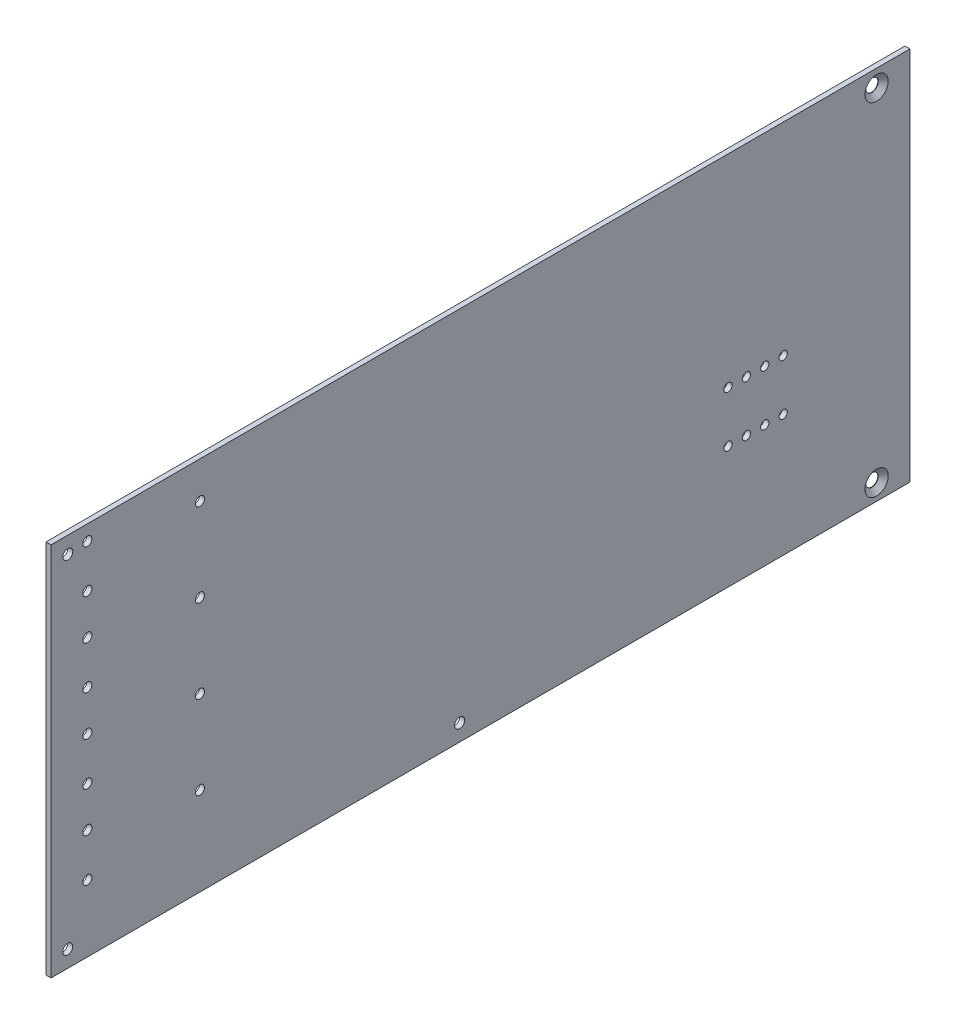
ISO-10303-21;
HEADER;
FILE_DESCRIPTION(('STEP AP214'),'2;1');
FILE_NAME('part.step','',(''),(''),'','','');
FILE_SCHEMA(('AUTOMOTIVE_DESIGN { 1 0 10303 214 1 1 1 1 }'));
ENDSEC;
DATA;
#1=APPLICATION_CONTEXT('core data for automotive mechanical design processes');
#2=APPLICATION_PROTOCOL_DEFINITION('international standard','automotive_design',2000,#1);
#3=PRODUCT_CONTEXT('',#1,'mechanical');
#4=PRODUCT('Part','Part','',(#3));
#5=PRODUCT_RELATED_PRODUCT_CATEGORY('part','',(#4));
#6=PRODUCT_DEFINITION_FORMATION('','',#4);
#7=PRODUCT_DEFINITION_CONTEXT('part definition',#1,'design');
#8=PRODUCT_DEFINITION('design','',#6,#7);
#9=PRODUCT_DEFINITION_SHAPE('','',#8);
#10=(LENGTH_UNIT() NAMED_UNIT(*) SI_UNIT(.MILLI.,.METRE.));
#11=(NAMED_UNIT(*) PLANE_ANGLE_UNIT() SI_UNIT($,.RADIAN.));
#12=(NAMED_UNIT(*) SI_UNIT($,.STERADIAN.) SOLID_ANGLE_UNIT());
#13=UNCERTAINTY_MEASURE_WITH_UNIT(LENGTH_MEASURE(1.E-05),#10,'distance_accuracy_value','');
#14=(GEOMETRIC_REPRESENTATION_CONTEXT(3) GLOBAL_UNCERTAINTY_ASSIGNED_CONTEXT((#13)) GLOBAL_UNIT_ASSIGNED_CONTEXT((#10,
#11,#12)) REPRESENTATION_CONTEXT('',''));
#15=CARTESIAN_POINT('',(0.,0.,0.));
#16=DIRECTION('',(0.,0.,1.));
#17=DIRECTION('',(1.,0.,0.));
#18=AXIS2_PLACEMENT_3D('',#15,#16,#17);
#19=CARTESIAN_POINT('',(-1.524,57.15,130.81));
#20=DIRECTION('',(1.,0.,0.));
#21=DIRECTION('',(0.,1.,0.));
#22=AXIS2_PLACEMENT_3D('',#19,#20,#21);
#23=PLANE('',#22);
#24=DIRECTION('',(0.,-1.,0.));
#25=VECTOR('',#24,1.);
#26=CARTESIAN_POINT('',(-1.524,57.15,-130.81));
#27=LINE('',#26,#25);
#28=CARTESIAN_POINT('',(-1.524,57.15,-130.81));
#29=VERTEX_POINT('',#28);
#30=CARTESIAN_POINT('',(-1.524,-57.15,-130.81));
#31=VERTEX_POINT('',#30);
#32=EDGE_CURVE('E100',#29,#31,#27,.T.);
#33=ORIENTED_EDGE('',*,*,#32,.T.);
#34=DIRECTION('',(0.,0.,-1.));
#35=VECTOR('',#34,1.);
#36=CARTESIAN_POINT('',(-1.524,-57.15,130.81));
#37=LINE('',#36,#35);
#38=CARTESIAN_POINT('',(-1.524,-57.15,130.81));
#39=VERTEX_POINT('',#38);
#40=EDGE_CURVE('E11',#39,#31,#37,.T.);
#41=ORIENTED_EDGE('',*,*,#40,.F.);
#42=DIRECTION('',(0.,-1.,0.));
#43=VECTOR('',#42,1.);
#44=CARTESIAN_POINT('',(-1.524,57.15,130.81));
#45=LINE('',#44,#43);
#46=CARTESIAN_POINT('',(-1.524,57.15,130.81));
#47=VERTEX_POINT('',#46);
#48=EDGE_CURVE('E87',#47,#39,#45,.T.);
#49=ORIENTED_EDGE('',*,*,#48,.F.);
#50=DIRECTION('',(0.,0.,-1.));
#51=VECTOR('',#50,1.);
#52=CARTESIAN_POINT('',(-1.524,57.15,130.81));
#53=LINE('',#52,#51);
#54=EDGE_CURVE('E96',#47,#29,#53,.T.);
#55=ORIENTED_EDGE('',*,*,#54,.T.);
#56=EDGE_LOOP('',(#33,#41,#49,#55));
#57=FACE_BOUND('',#56,.T.);
#58=CARTESIAN_POINT('',(-1.524,-52.197,-120.65));
#59=DIRECTION('',(1.,0.,0.));
#60=DIRECTION('',(0.,0.,-1.));
#61=AXIS2_PLACEMENT_3D('',#58,#59,#60);
#62=CIRCLE('',#61,1.89865);
#63=CARTESIAN_POINT('',(-1.524,-52.197,-122.54865));
#64=VERTEX_POINT('',#63);
#65=EDGE_CURVE('E103',#64,#64,#62,.T.);
#66=ORIENTED_EDGE('',*,*,#65,.T.);
#67=EDGE_LOOP('',(#66));
#68=FACE_BOUND('',#67,.T.);
#69=CARTESIAN_POINT('',(-1.524,51.943,-120.65));
#70=DIRECTION('',(1.,0.,0.));
#71=DIRECTION('',(0.,0.,-1.));
#72=AXIS2_PLACEMENT_3D('',#69,#70,#71);
#73=CIRCLE('',#72,1.89865);
#74=CARTESIAN_POINT('',(-1.524,51.943,-122.54865));
#75=VERTEX_POINT('',#74);
#76=EDGE_CURVE('E253',#75,#75,#73,.T.);
#77=ORIENTED_EDGE('',*,*,#76,.T.);
#78=EDGE_LOOP('',(#77));
#79=FACE_BOUND('',#78,.T.);
#80=CARTESIAN_POINT('',(-1.524,-36.7792,119.761));
#81=DIRECTION('',(-1.,0.,0.));
#82=DIRECTION('',(0.,0.,1.));
#83=AXIS2_PLACEMENT_3D('',#80,#81,#82);
#84=CIRCLE('',#83,1.38912599999999);
#85=CARTESIAN_POINT('',(-1.524,-36.7792,121.150126));
#86=VERTEX_POINT('',#85);
#87=EDGE_CURVE('E241',#86,#86,#84,.T.);
#88=ORIENTED_EDGE('',*,*,#87,.F.);
#89=EDGE_LOOP('',(#88));
#90=FACE_BOUND('',#89,.T.);
#91=CARTESIAN_POINT('',(-1.524,-23.6474,119.761));
#92=DIRECTION('',(-1.,0.,0.));
#93=DIRECTION('',(0.,0.,1.));
#94=AXIS2_PLACEMENT_3D('',#91,#92,#93);
#95=CIRCLE('',#94,1.38912599999999);
#96=CARTESIAN_POINT('',(-1.524,-23.6474,121.150126));
#97=VERTEX_POINT('',#96);
#98=EDGE_CURVE('E235',#97,#97,#95,.T.);
#99=ORIENTED_EDGE('',*,*,#98,.F.);
#100=EDGE_LOOP('',(#99));
#101=FACE_BOUND('',#100,.T.);
#102=CARTESIAN_POINT('',(-1.524,-30.226,85.4709999999999));
#103=DIRECTION('',(-1.,0.,0.));
#104=DIRECTION('',(0.,0.,1.));
#105=AXIS2_PLACEMENT_3D('',#102,#103,#104);
#106=CIRCLE('',#105,1.38912599999999);
#107=CARTESIAN_POINT('',(-1.524,-30.226,86.8601259999999));
#108=VERTEX_POINT('',#107);
#109=EDGE_CURVE('E229',#108,#108,#106,.T.);
#110=ORIENTED_EDGE('',*,*,#109,.F.);
#111=EDGE_LOOP('',(#110));
#112=FACE_BOUND('',#111,.T.);
#113=CARTESIAN_POINT('',(-1.524,-4.82600000000002,85.4709999999999));
#114=DIRECTION('',(-1.,0.,0.));
#115=DIRECTION('',(0.,0.,1.));
#116=AXIS2_PLACEMENT_3D('',#113,#114,#115);
#117=CIRCLE('',#116,1.38912599999999);
#118=CARTESIAN_POINT('',(-1.524,-4.82600000000002,86.8601259999999));
#119=VERTEX_POINT('',#118);
#120=EDGE_CURVE('E223',#119,#119,#117,.T.);
#121=ORIENTED_EDGE('',*,*,#120,.F.);
#122=EDGE_LOOP('',(#121));
#123=FACE_BOUND('',#122,.T.);
#124=CARTESIAN_POINT('',(-1.524,-11.3792,119.761));
#125=DIRECTION('',(-1.,0.,0.));
#126=DIRECTION('',(0.,0.,1.));
#127=AXIS2_PLACEMENT_3D('',#124,#125,#126);
#128=CIRCLE('',#127,1.38912599999999);
#129=CARTESIAN_POINT('',(-1.524,-11.3792,121.150126));
#130=VERTEX_POINT('',#129);
#131=EDGE_CURVE('E217',#130,#130,#128,.T.);
#132=ORIENTED_EDGE('',*,*,#131,.F.);
#133=EDGE_LOOP('',(#132));
#134=FACE_BOUND('',#133,.T.);
#135=CARTESIAN_POINT('',(-1.524,1.75259999999999,119.761));
#136=DIRECTION('',(-1.,0.,0.));
#137=DIRECTION('',(0.,0.,1.));
#138=AXIS2_PLACEMENT_3D('',#135,#136,#137);
#139=CIRCLE('',#138,1.38912599999999);
#140=CARTESIAN_POINT('',(-1.524,1.75259999999999,121.150126));
#141=VERTEX_POINT('',#140);
#142=EDGE_CURVE('E211',#141,#141,#139,.T.);
#143=ORIENTED_EDGE('',*,*,#142,.F.);
#144=EDGE_LOOP('',(#143));
#145=FACE_BOUND('',#144,.T.);
#146=CARTESIAN_POINT('',(-1.524,14.0208,119.761));
#147=DIRECTION('',(-1.,0.,0.));
#148=DIRECTION('',(0.,0.,1.));
#149=AXIS2_PLACEMENT_3D('',#146,#147,#148);
#150=CIRCLE('',#149,1.38912599999999);
#151=CARTESIAN_POINT('',(-1.524,14.0208,121.150126));
#152=VERTEX_POINT('',#151);
#153=EDGE_CURVE('E205',#152,#152,#150,.T.);
#154=ORIENTED_EDGE('',*,*,#153,.F.);
#155=EDGE_LOOP('',(#154));
#156=FACE_BOUND('',#155,.T.);
#157=CARTESIAN_POINT('',(-1.524,20.574,85.4709999999999));
#158=DIRECTION('',(-1.,0.,0.));
#159=DIRECTION('',(0.,0.,1.));
#160=AXIS2_PLACEMENT_3D('',#157,#158,#159);
#161=CIRCLE('',#160,1.38912599999999);
#162=CARTESIAN_POINT('',(-1.524,20.574,86.8601259999999));
#163=VERTEX_POINT('',#162);
#164=EDGE_CURVE('E199',#163,#163,#161,.T.);
#165=ORIENTED_EDGE('',*,*,#164,.F.);
#166=EDGE_LOOP('',(#165));
#167=FACE_BOUND('',#166,.T.);
#168=CARTESIAN_POINT('',(-1.524,27.1526,119.761));
#169=DIRECTION('',(-1.,0.,0.));
#170=DIRECTION('',(0.,0.,1.));
#171=AXIS2_PLACEMENT_3D('',#168,#169,#170);
#172=CIRCLE('',#171,1.38912599999999);
#173=CARTESIAN_POINT('',(-1.524,27.1526,121.150126));
#174=VERTEX_POINT('',#173);
#175=EDGE_CURVE('E193',#174,#174,#172,.T.);
#176=ORIENTED_EDGE('',*,*,#175,.F.);
#177=EDGE_LOOP('',(#176));
#178=FACE_BOUND('',#177,.T.);
#179=CARTESIAN_POINT('',(-1.524,39.4208,119.761));
#180=DIRECTION('',(-1.,0.,0.));
#181=DIRECTION('',(0.,0.,1.));
#182=AXIS2_PLACEMENT_3D('',#179,#180,#181);
#183=CIRCLE('',#182,1.38912599999999);
#184=CARTESIAN_POINT('',(-1.524,39.4208,121.150126));
#185=VERTEX_POINT('',#184);
#186=EDGE_CURVE('E187',#185,#185,#183,.T.);
#187=ORIENTED_EDGE('',*,*,#186,.F.);
#188=EDGE_LOOP('',(#187));
#189=FACE_BOUND('',#188,.T.);
#190=CARTESIAN_POINT('',(-1.524,45.974,85.4709999999999));
#191=DIRECTION('',(-1.,0.,0.));
#192=DIRECTION('',(0.,0.,1.));
#193=AXIS2_PLACEMENT_3D('',#190,#191,#192);
#194=CIRCLE('',#193,1.38912599999999);
#195=CARTESIAN_POINT('',(-1.524,45.974,86.8601259999999));
#196=VERTEX_POINT('',#195);
#197=EDGE_CURVE('E181',#196,#196,#194,.T.);
#198=ORIENTED_EDGE('',*,*,#197,.F.);
#199=EDGE_LOOP('',(#198));
#200=FACE_BOUND('',#199,.T.);
#201=CARTESIAN_POINT('',(-1.524,52.5525999999999,119.761));
#202=DIRECTION('',(-1.,0.,0.));
#203=DIRECTION('',(0.,0.,1.));
#204=AXIS2_PLACEMENT_3D('',#201,#202,#203);
#205=CIRCLE('',#204,1.38912599999999);
#206=CARTESIAN_POINT('',(-1.524,52.5525999999999,121.150126));
#207=VERTEX_POINT('',#206);
#208=EDGE_CURVE('E175',#207,#207,#205,.T.);
#209=ORIENTED_EDGE('',*,*,#208,.F.);
#210=EDGE_LOOP('',(#209));
#211=FACE_BOUND('',#210,.T.);
#212=CARTESIAN_POINT('',(-1.524,-52.07,6.34999999999999));
#213=DIRECTION('',(-1.,0.,0.));
#214=DIRECTION('',(0.,0.,1.));
#215=AXIS2_PLACEMENT_3D('',#212,#213,#214);
#216=CIRCLE('',#215,1.52399999999998);
#217=CARTESIAN_POINT('',(-1.524,-52.07,7.87399999999998));
#218=VERTEX_POINT('',#217);
#219=EDGE_CURVE('E169',#218,#218,#216,.T.);
#220=ORIENTED_EDGE('',*,*,#219,.F.);
#221=EDGE_LOOP('',(#220));
#222=FACE_BOUND('',#221,.T.);
#223=CARTESIAN_POINT('',(-1.524,-52.07,125.73));
#224=DIRECTION('',(-1.,0.,0.));
#225=DIRECTION('',(0.,0.,1.));
#226=AXIS2_PLACEMENT_3D('',#223,#224,#225);
#227=CIRCLE('',#226,1.52399999999998);
#228=CARTESIAN_POINT('',(-1.524,-52.07,127.254));
#229=VERTEX_POINT('',#228);
#230=EDGE_CURVE('E163',#229,#229,#227,.T.);
#231=ORIENTED_EDGE('',*,*,#230,.F.);
#232=EDGE_LOOP('',(#231));
#233=FACE_BOUND('',#232,.T.);
#234=CARTESIAN_POINT('',(-1.524,52.07,125.73));
#235=DIRECTION('',(-1.,0.,0.));
#236=DIRECTION('',(0.,0.,1.));
#237=AXIS2_PLACEMENT_3D('',#234,#235,#236);
#238=CIRCLE('',#237,1.52399999999998);
#239=CARTESIAN_POINT('',(-1.524,52.07,127.254));
#240=VERTEX_POINT('',#239);
#241=EDGE_CURVE('E112',#240,#240,#238,.T.);
#242=ORIENTED_EDGE('',*,*,#241,.F.);
#243=EDGE_LOOP('',(#242));
#244=FACE_BOUND('',#243,.T.);
#245=CARTESIAN_POINT('',(-1.524,-19.939,-92.202));
#246=DIRECTION('',(-1.,0.,0.));
#247=DIRECTION('',(0.,0.,1.));
#248=AXIS2_PLACEMENT_3D('',#245,#246,#247);
#249=CIRCLE('',#248,1.26365);
#250=CARTESIAN_POINT('',(-1.524,-19.939,-90.93835));
#251=VERTEX_POINT('',#250);
#252=EDGE_CURVE('E113',#251,#251,#249,.T.);
#253=ORIENTED_EDGE('',*,*,#252,.F.);
#254=EDGE_LOOP('',(#253));
#255=FACE_BOUND('',#254,.T.);
#256=CARTESIAN_POINT('',(-1.524,-19.939,-86.5886));
#257=DIRECTION('',(-1.,0.,0.));
#258=DIRECTION('',(0.,0.,1.));
#259=AXIS2_PLACEMENT_3D('',#256,#257,#258);
#260=CIRCLE('',#259,1.26365);
#261=CARTESIAN_POINT('',(-1.524,-19.939,-85.32495));
#262=VERTEX_POINT('',#261);
#263=EDGE_CURVE('E117',#262,#262,#260,.T.);
#264=ORIENTED_EDGE('',*,*,#263,.F.);
#265=EDGE_LOOP('',(#264));
#266=FACE_BOUND('',#265,.T.);
#267=CARTESIAN_POINT('',(-1.524,-19.939,-81.0006));
#268=DIRECTION('',(-1.,0.,0.));
#269=DIRECTION('',(0.,0.,1.));
#270=AXIS2_PLACEMENT_3D('',#267,#268,#269);
#271=CIRCLE('',#270,1.26365);
#272=CARTESIAN_POINT('',(-1.524,-19.939,-79.73695));
#273=VERTEX_POINT('',#272);
#274=EDGE_CURVE('E121',#273,#273,#271,.T.);
#275=ORIENTED_EDGE('',*,*,#274,.F.);
#276=EDGE_LOOP('',(#275));
#277=FACE_BOUND('',#276,.T.);
#278=CARTESIAN_POINT('',(-1.524,-19.939,-75.3872));
#279=DIRECTION('',(-1.,0.,0.));
#280=DIRECTION('',(0.,0.,1.));
#281=AXIS2_PLACEMENT_3D('',#278,#279,#280);
#282=CIRCLE('',#281,1.26365);
#283=CARTESIAN_POINT('',(-1.524,-19.939,-74.12355));
#284=VERTEX_POINT('',#283);
#285=EDGE_CURVE('E122',#284,#284,#282,.T.);
#286=ORIENTED_EDGE('',*,*,#285,.F.);
#287=EDGE_LOOP('',(#286));
#288=FACE_BOUND('',#287,.T.);
#289=CARTESIAN_POINT('',(-1.524,-4.44500000000003,-75.3872));
#290=DIRECTION('',(-1.,0.,0.));
#291=DIRECTION('',(0.,0.,1.));
#292=AXIS2_PLACEMENT_3D('',#289,#290,#291);
#293=CIRCLE('',#292,1.26365);
#294=CARTESIAN_POINT('',(-1.524,-4.44500000000003,-74.12355));
#295=VERTEX_POINT('',#294);
#296=EDGE_CURVE('E125',#295,#295,#293,.T.);
#297=ORIENTED_EDGE('',*,*,#296,.F.);
#298=EDGE_LOOP('',(#297));
#299=FACE_BOUND('',#298,.T.);
#300=CARTESIAN_POINT('',(-1.524,-4.44500000000003,-81.0006));
#301=DIRECTION('',(-1.,0.,0.));
#302=DIRECTION('',(0.,0.,1.));
#303=AXIS2_PLACEMENT_3D('',#300,#301,#302);
#304=CIRCLE('',#303,1.26365);
#305=CARTESIAN_POINT('',(-1.524,-4.44500000000003,-79.73695));
#306=VERTEX_POINT('',#305);
#307=EDGE_CURVE('E126',#306,#306,#304,.T.);
#308=ORIENTED_EDGE('',*,*,#307,.F.);
#309=EDGE_LOOP('',(#308));
#310=FACE_BOUND('',#309,.T.);
#311=CARTESIAN_POINT('',(-1.524,-4.44500000000003,-86.5886));
#312=DIRECTION('',(-1.,0.,0.));
#313=DIRECTION('',(0.,0.,1.));
#314=AXIS2_PLACEMENT_3D('',#311,#312,#313);
#315=CIRCLE('',#314,1.26365);
#316=CARTESIAN_POINT('',(-1.524,-4.44500000000003,-85.32495));
#317=VERTEX_POINT('',#316);
#318=EDGE_CURVE('E129',#317,#317,#315,.T.);
#319=ORIENTED_EDGE('',*,*,#318,.F.);
#320=EDGE_LOOP('',(#319));
#321=FACE_BOUND('',#320,.T.);
#322=CARTESIAN_POINT('',(-1.524,-4.44500000000003,-92.202));
#323=DIRECTION('',(-1.,0.,0.));
#324=DIRECTION('',(0.,0.,1.));
#325=AXIS2_PLACEMENT_3D('',#322,#323,#324);
#326=CIRCLE('',#325,1.26365);
#327=CARTESIAN_POINT('',(-1.524,-4.44500000000003,-90.93835));
#328=VERTEX_POINT('',#327);
#329=EDGE_CURVE('E139',#328,#328,#326,.T.);
#330=ORIENTED_EDGE('',*,*,#329,.F.);
#331=EDGE_LOOP('',(#330));
#332=FACE_BOUND('',#331,.T.);
#333=ADVANCED_FACE('F34',(#57,#68,#79,#90,#101,#112,#123,#134,#145,#156,#167,#178,#189,#200,
#211,#222,#233,#244,#255,#266,#277,#288,#299,#310,#321,#332),#23,.F.);
#334=CARTESIAN_POINT('',(-1.524,-57.15,130.81));
#335=DIRECTION('',(0.,1.,0.));
#336=DIRECTION('',(-1.,0.,0.));
#337=AXIS2_PLACEMENT_3D('',#334,#335,#336);
#338=PLANE('',#337);
#339=DIRECTION('',(1.,0.,0.));
#340=VECTOR('',#339,1.);
#341=CARTESIAN_POINT('',(-1.524,-57.15,-130.81));
#342=LINE('',#341,#340);
#343=CARTESIAN_POINT('',(0.,-57.15,-130.81));
#344=VERTEX_POINT('',#343);
#345=EDGE_CURVE('E91',#31,#344,#342,.T.);
#346=ORIENTED_EDGE('',*,*,#345,.T.);
#347=DIRECTION('',(0.,0.,-1.));
#348=VECTOR('',#347,1.);
#349=CARTESIAN_POINT('',(0.,-57.15,130.81));
#350=LINE('',#349,#348);
#351=CARTESIAN_POINT('',(0.,-57.15,130.81));
#352=VERTEX_POINT('',#351);
#353=EDGE_CURVE('E43',#352,#344,#350,.T.);
#354=ORIENTED_EDGE('',*,*,#353,.F.);
#355=DIRECTION('',(1.,0.,0.));
#356=VECTOR('',#355,1.);
#357=CARTESIAN_POINT('',(-1.524,-57.15,130.81));
#358=LINE('',#357,#356);
#359=EDGE_CURVE('E82',#39,#352,#358,.T.);
#360=ORIENTED_EDGE('',*,*,#359,.F.);
#361=ORIENTED_EDGE('',*,*,#40,.T.);
#362=EDGE_LOOP('',(#346,#354,#360,#361));
#363=FACE_BOUND('',#362,.T.);
#364=ADVANCED_FACE('F90',(#363),#338,.F.);
#365=CARTESIAN_POINT('',(0.,57.15,130.81));
#366=DIRECTION('',(-1.,0.,0.));
#367=DIRECTION('',(0.,0.,1.));
#368=AXIS2_PLACEMENT_3D('',#365,#366,#367);
#369=PLANE('',#368);
#370=CARTESIAN_POINT('',(0.,-4.44500000000003,-92.202));
#371=DIRECTION('',(-1.,0.,0.));
#372=DIRECTION('',(0.,0.,1.));
#373=AXIS2_PLACEMENT_3D('',#370,#371,#372);
#374=CIRCLE('',#373,1.26365);
#375=CARTESIAN_POINT('',(0.,-4.44500000000003,-90.93835));
#376=VERTEX_POINT('',#375);
#377=EDGE_CURVE('E37',#376,#376,#374,.T.);
#378=ORIENTED_EDGE('',*,*,#377,.T.);
#379=EDGE_LOOP('',(#378));
#380=FACE_BOUND('',#379,.T.);
#381=CARTESIAN_POINT('',(0.,-4.44500000000003,-86.5886));
#382=DIRECTION('',(-1.,0.,0.));
#383=DIRECTION('',(0.,0.,1.));
#384=AXIS2_PLACEMENT_3D('',#381,#382,#383);
#385=CIRCLE('',#384,1.26365);
#386=CARTESIAN_POINT('',(0.,-4.44500000000003,-85.32495));
#387=VERTEX_POINT('',#386);
#388=EDGE_CURVE('E127',#387,#387,#385,.T.);
#389=ORIENTED_EDGE('',*,*,#388,.T.);
#390=EDGE_LOOP('',(#389));
#391=FACE_BOUND('',#390,.T.);
#392=CARTESIAN_POINT('',(0.,-4.44500000000003,-81.0006));
#393=DIRECTION('',(-1.,0.,0.));
#394=DIRECTION('',(0.,0.,1.));
#395=AXIS2_PLACEMENT_3D('',#392,#393,#394);
#396=CIRCLE('',#395,1.26365);
#397=CARTESIAN_POINT('',(0.,-4.44500000000003,-79.73695));
#398=VERTEX_POINT('',#397);
#399=EDGE_CURVE('E123',#398,#398,#396,.T.);
#400=ORIENTED_EDGE('',*,*,#399,.T.);
#401=EDGE_LOOP('',(#400));
#402=FACE_BOUND('',#401,.T.);
#403=CARTESIAN_POINT('',(0.,-4.44500000000003,-75.3872));
#404=DIRECTION('',(-1.,0.,0.));
#405=DIRECTION('',(0.,0.,1.));
#406=AXIS2_PLACEMENT_3D('',#403,#404,#405);
#407=CIRCLE('',#406,1.26365);
#408=CARTESIAN_POINT('',(0.,-4.44500000000003,-74.12355));
#409=VERTEX_POINT('',#408);
#410=EDGE_CURVE('E144',#409,#409,#407,.T.);
#411=ORIENTED_EDGE('',*,*,#410,.T.);
#412=EDGE_LOOP('',(#411));
#413=FACE_BOUND('',#412,.T.);
#414=CARTESIAN_POINT('',(0.,-19.939,-75.3872));
#415=DIRECTION('',(-1.,0.,0.));
#416=DIRECTION('',(0.,0.,1.));
#417=AXIS2_PLACEMENT_3D('',#414,#415,#416);
#418=CIRCLE('',#417,1.26365);
#419=CARTESIAN_POINT('',(0.,-19.939,-74.12355));
#420=VERTEX_POINT('',#419);
#421=EDGE_CURVE('E118',#420,#420,#418,.T.);
#422=ORIENTED_EDGE('',*,*,#421,.T.);
#423=EDGE_LOOP('',(#422));
#424=FACE_BOUND('',#423,.T.);
#425=CARTESIAN_POINT('',(0.,-19.939,-81.0006));
#426=DIRECTION('',(-1.,0.,0.));
#427=DIRECTION('',(0.,0.,1.));
#428=AXIS2_PLACEMENT_3D('',#425,#426,#427);
#429=CIRCLE('',#428,1.26365);
#430=CARTESIAN_POINT('',(0.,-19.939,-79.73695));
#431=VERTEX_POINT('',#430);
#432=EDGE_CURVE('E151',#431,#431,#429,.T.);
#433=ORIENTED_EDGE('',*,*,#432,.T.);
#434=EDGE_LOOP('',(#433));
#435=FACE_BOUND('',#434,.T.);
#436=CARTESIAN_POINT('',(0.,-19.939,-86.5886));
#437=DIRECTION('',(-1.,0.,0.));
#438=DIRECTION('',(0.,0.,1.));
#439=AXIS2_PLACEMENT_3D('',#436,#437,#438);
#440=CIRCLE('',#439,1.26365);
#441=CARTESIAN_POINT('',(0.,-19.939,-85.32495));
#442=VERTEX_POINT('',#441);
#443=EDGE_CURVE('E114',#442,#442,#440,.T.);
#444=ORIENTED_EDGE('',*,*,#443,.T.);
#445=EDGE_LOOP('',(#444));
#446=FACE_BOUND('',#445,.T.);
#447=CARTESIAN_POINT('',(0.,-19.939,-92.202));
#448=DIRECTION('',(-1.,0.,0.));
#449=DIRECTION('',(0.,0.,1.));
#450=AXIS2_PLACEMENT_3D('',#447,#448,#449);
#451=CIRCLE('',#450,1.26365);
#452=CARTESIAN_POINT('',(0.,-19.939,-90.93835));
#453=VERTEX_POINT('',#452);
#454=EDGE_CURVE('E109',#453,#453,#451,.T.);
#455=ORIENTED_EDGE('',*,*,#454,.T.);
#456=EDGE_LOOP('',(#455));
#457=FACE_BOUND('',#456,.T.);
#458=CARTESIAN_POINT('',(0.,52.07,125.73));
#459=DIRECTION('',(-1.,0.,0.));
#460=DIRECTION('',(0.,0.,1.));
#461=AXIS2_PLACEMENT_3D('',#458,#459,#460);
#462=CIRCLE('',#461,1.524);
#463=CARTESIAN_POINT('',(0.,52.07,127.254));
#464=VERTEX_POINT('',#463);
#465=EDGE_CURVE('E160',#464,#464,#462,.T.);
#466=ORIENTED_EDGE('',*,*,#465,.T.);
#467=EDGE_LOOP('',(#466));
#468=FACE_BOUND('',#467,.T.);
#469=CARTESIAN_POINT('',(0.,-52.07,125.73));
#470=DIRECTION('',(-1.,0.,0.));
#471=DIRECTION('',(0.,0.,1.));
#472=AXIS2_PLACEMENT_3D('',#469,#470,#471);
#473=CIRCLE('',#472,1.524);
#474=CARTESIAN_POINT('',(0.,-52.07,127.254));
#475=VERTEX_POINT('',#474);
#476=EDGE_CURVE('E166',#475,#475,#473,.T.);
#477=ORIENTED_EDGE('',*,*,#476,.T.);
#478=EDGE_LOOP('',(#477));
#479=FACE_BOUND('',#478,.T.);
#480=CARTESIAN_POINT('',(0.,-52.07,6.34999999999999));
#481=DIRECTION('',(-1.,0.,0.));
#482=DIRECTION('',(0.,0.,1.));
#483=AXIS2_PLACEMENT_3D('',#480,#481,#482);
#484=CIRCLE('',#483,1.524);
#485=CARTESIAN_POINT('',(0.,-52.07,7.87399999999999));
#486=VERTEX_POINT('',#485);
#487=EDGE_CURVE('E172',#486,#486,#484,.T.);
#488=ORIENTED_EDGE('',*,*,#487,.T.);
#489=EDGE_LOOP('',(#488));
#490=FACE_BOUND('',#489,.T.);
#491=CARTESIAN_POINT('',(0.,52.5525999999999,119.761));
#492=DIRECTION('',(-1.,0.,0.));
#493=DIRECTION('',(0.,0.,1.));
#494=AXIS2_PLACEMENT_3D('',#491,#492,#493);
#495=CIRCLE('',#494,1.389126);
#496=CARTESIAN_POINT('',(0.,52.5525999999999,121.150126));
#497=VERTEX_POINT('',#496);
#498=EDGE_CURVE('E178',#497,#497,#495,.T.);
#499=ORIENTED_EDGE('',*,*,#498,.T.);
#500=EDGE_LOOP('',(#499));
#501=FACE_BOUND('',#500,.T.);
#502=CARTESIAN_POINT('',(0.,45.974,85.4709999999999));
#503=DIRECTION('',(-1.,0.,0.));
#504=DIRECTION('',(0.,0.,1.));
#505=AXIS2_PLACEMENT_3D('',#502,#503,#504);
#506=CIRCLE('',#505,1.389126);
#507=CARTESIAN_POINT('',(0.,45.974,86.8601259999999));
#508=VERTEX_POINT('',#507);
#509=EDGE_CURVE('E184',#508,#508,#506,.T.);
#510=ORIENTED_EDGE('',*,*,#509,.T.);
#511=EDGE_LOOP('',(#510));
#512=FACE_BOUND('',#511,.T.);
#513=CARTESIAN_POINT('',(0.,39.4208,119.761));
#514=DIRECTION('',(-1.,0.,0.));
#515=DIRECTION('',(0.,0.,1.));
#516=AXIS2_PLACEMENT_3D('',#513,#514,#515);
#517=CIRCLE('',#516,1.389126);
#518=CARTESIAN_POINT('',(0.,39.4208,121.150126));
#519=VERTEX_POINT('',#518);
#520=EDGE_CURVE('E190',#519,#519,#517,.T.);
#521=ORIENTED_EDGE('',*,*,#520,.T.);
#522=EDGE_LOOP('',(#521));
#523=FACE_BOUND('',#522,.T.);
#524=CARTESIAN_POINT('',(0.,27.1526,119.761));
#525=DIRECTION('',(-1.,0.,0.));
#526=DIRECTION('',(0.,0.,1.));
#527=AXIS2_PLACEMENT_3D('',#524,#525,#526);
#528=CIRCLE('',#527,1.389126);
#529=CARTESIAN_POINT('',(0.,27.1526,121.150126));
#530=VERTEX_POINT('',#529);
#531=EDGE_CURVE('E196',#530,#530,#528,.T.);
#532=ORIENTED_EDGE('',*,*,#531,.T.);
#533=EDGE_LOOP('',(#532));
#534=FACE_BOUND('',#533,.T.);
#535=CARTESIAN_POINT('',(0.,20.574,85.4709999999999));
#536=DIRECTION('',(-1.,0.,0.));
#537=DIRECTION('',(0.,0.,1.));
#538=AXIS2_PLACEMENT_3D('',#535,#536,#537);
#539=CIRCLE('',#538,1.389126);
#540=CARTESIAN_POINT('',(0.,20.574,86.8601259999999));
#541=VERTEX_POINT('',#540);
#542=EDGE_CURVE('E202',#541,#541,#539,.T.);
#543=ORIENTED_EDGE('',*,*,#542,.T.);
#544=EDGE_LOOP('',(#543));
#545=FACE_BOUND('',#544,.T.);
#546=CARTESIAN_POINT('',(0.,14.0208,119.761));
#547=DIRECTION('',(-1.,0.,0.));
#548=DIRECTION('',(0.,0.,1.));
#549=AXIS2_PLACEMENT_3D('',#546,#547,#548);
#550=CIRCLE('',#549,1.389126);
#551=CARTESIAN_POINT('',(0.,14.0208,121.150126));
#552=VERTEX_POINT('',#551);
#553=EDGE_CURVE('E208',#552,#552,#550,.T.);
#554=ORIENTED_EDGE('',*,*,#553,.T.);
#555=EDGE_LOOP('',(#554));
#556=FACE_BOUND('',#555,.T.);
#557=CARTESIAN_POINT('',(0.,1.75259999999999,119.761));
#558=DIRECTION('',(-1.,0.,0.));
#559=DIRECTION('',(0.,0.,1.));
#560=AXIS2_PLACEMENT_3D('',#557,#558,#559);
#561=CIRCLE('',#560,1.389126);
#562=CARTESIAN_POINT('',(0.,1.75259999999999,121.150126));
#563=VERTEX_POINT('',#562);
#564=EDGE_CURVE('E214',#563,#563,#561,.T.);
#565=ORIENTED_EDGE('',*,*,#564,.T.);
#566=EDGE_LOOP('',(#565));
#567=FACE_BOUND('',#566,.T.);
#568=CARTESIAN_POINT('',(0.,-11.3792,119.761));
#569=DIRECTION('',(-1.,0.,0.));
#570=DIRECTION('',(0.,0.,1.));
#571=AXIS2_PLACEMENT_3D('',#568,#569,#570);
#572=CIRCLE('',#571,1.389126);
#573=CARTESIAN_POINT('',(0.,-11.3792,121.150126));
#574=VERTEX_POINT('',#573);
#575=EDGE_CURVE('E220',#574,#574,#572,.T.);
#576=ORIENTED_EDGE('',*,*,#575,.T.);
#577=EDGE_LOOP('',(#576));
#578=FACE_BOUND('',#577,.T.);
#579=CARTESIAN_POINT('',(0.,-4.82600000000002,85.4709999999999));
#580=DIRECTION('',(-1.,0.,0.));
#581=DIRECTION('',(0.,0.,1.));
#582=AXIS2_PLACEMENT_3D('',#579,#580,#581);
#583=CIRCLE('',#582,1.389126);
#584=CARTESIAN_POINT('',(0.,-4.82600000000002,86.8601259999999));
#585=VERTEX_POINT('',#584);
#586=EDGE_CURVE('E226',#585,#585,#583,.T.);
#587=ORIENTED_EDGE('',*,*,#586,.T.);
#588=EDGE_LOOP('',(#587));
#589=FACE_BOUND('',#588,.T.);
#590=CARTESIAN_POINT('',(0.,-30.226,85.4709999999999));
#591=DIRECTION('',(-1.,0.,0.));
#592=DIRECTION('',(0.,0.,1.));
#593=AXIS2_PLACEMENT_3D('',#590,#591,#592);
#594=CIRCLE('',#593,1.389126);
#595=CARTESIAN_POINT('',(0.,-30.226,86.8601259999999));
#596=VERTEX_POINT('',#595);
#597=EDGE_CURVE('E232',#596,#596,#594,.T.);
#598=ORIENTED_EDGE('',*,*,#597,.T.);
#599=EDGE_LOOP('',(#598));
#600=FACE_BOUND('',#599,.T.);
#601=CARTESIAN_POINT('',(0.,-23.6474,119.761));
#602=DIRECTION('',(-1.,0.,0.));
#603=DIRECTION('',(0.,0.,1.));
#604=AXIS2_PLACEMENT_3D('',#601,#602,#603);
#605=CIRCLE('',#604,1.389126);
#606=CARTESIAN_POINT('',(0.,-23.6474,121.150126));
#607=VERTEX_POINT('',#606);
#608=EDGE_CURVE('E238',#607,#607,#605,.T.);
#609=ORIENTED_EDGE('',*,*,#608,.T.);
#610=EDGE_LOOP('',(#609));
#611=FACE_BOUND('',#610,.T.);
#612=CARTESIAN_POINT('',(0.,-36.7792,119.761));
#613=DIRECTION('',(-1.,0.,0.));
#614=DIRECTION('',(0.,0.,1.));
#615=AXIS2_PLACEMENT_3D('',#612,#613,#614);
#616=CIRCLE('',#615,1.389126);
#617=CARTESIAN_POINT('',(0.,-36.7792,121.150126));
#618=VERTEX_POINT('',#617);
#619=EDGE_CURVE('E244',#618,#618,#616,.T.);
#620=ORIENTED_EDGE('',*,*,#619,.T.);
#621=EDGE_LOOP('',(#620));
#622=FACE_BOUND('',#621,.T.);
#623=CARTESIAN_POINT('',(0.,51.943,-120.65));
#624=DIRECTION('',(1.,0.,0.));
#625=DIRECTION('',(0.,0.,-1.));
#626=AXIS2_PLACEMENT_3D('',#623,#624,#625);
#627=CIRCLE('',#626,3.543305461);
#628=CARTESIAN_POINT('',(0.,51.943,-124.193305461));
#629=VERTEX_POINT('',#628);
#630=EDGE_CURVE('E247',#629,#629,#627,.T.);
#631=ORIENTED_EDGE('',*,*,#630,.F.);
#632=EDGE_LOOP('',(#631));
#633=FACE_BOUND('',#632,.T.);
#634=CARTESIAN_POINT('',(0.,-52.197,-120.65));
#635=DIRECTION('',(1.,0.,0.));
#636=DIRECTION('',(0.,0.,-1.));
#637=AXIS2_PLACEMENT_3D('',#634,#635,#636);
#638=CIRCLE('',#637,3.543305461);
#639=CARTESIAN_POINT('',(0.,-52.197,-124.193305461));
#640=VERTEX_POINT('',#639);
#641=EDGE_CURVE('E256',#640,#640,#638,.T.);
#642=ORIENTED_EDGE('',*,*,#641,.F.);
#643=EDGE_LOOP('',(#642));
#644=FACE_BOUND('',#643,.T.);
#645=DIRECTION('',(0.,1.,0.));
#646=VECTOR('',#645,1.);
#647=CARTESIAN_POINT('',(0.,57.15,-130.81));
#648=LINE('',#647,#646);
#649=CARTESIAN_POINT('',(0.,57.15,-130.81));
#650=VERTEX_POINT('',#649);
#651=EDGE_CURVE('E69',#344,#650,#648,.T.);
#652=ORIENTED_EDGE('',*,*,#651,.T.);
#653=DIRECTION('',(0.,0.,-1.));
#654=VECTOR('',#653,1.);
#655=CARTESIAN_POINT('',(0.,57.15,130.81));
#656=LINE('',#655,#654);
#657=CARTESIAN_POINT('',(0.,57.15,130.81));
#658=VERTEX_POINT('',#657);
#659=EDGE_CURVE('E92',#658,#650,#656,.T.);
#660=ORIENTED_EDGE('',*,*,#659,.F.);
#661=DIRECTION('',(0.,1.,0.));
#662=VECTOR('',#661,1.);
#663=CARTESIAN_POINT('',(0.,57.15,130.81));
#664=LINE('',#663,#662);
#665=EDGE_CURVE('E85',#352,#658,#664,.T.);
#666=ORIENTED_EDGE('',*,*,#665,.F.);
#667=ORIENTED_EDGE('',*,*,#353,.T.);
#668=EDGE_LOOP('',(#652,#660,#666,#667));
#669=FACE_BOUND('',#668,.T.);
#670=ADVANCED_FACE('F94',(#380,#391,#402,#413,#424,#435,#446,#457,#468,#479,#490,#501,#512,#523,
#534,#545,#556,#567,#578,#589,#600,#611,#622,#633,#644,#669),#369,.F.);
#671=CARTESIAN_POINT('',(-1.524,57.15,130.81));
#672=DIRECTION('',(0.,-1.,0.));
#673=DIRECTION('',(0.,0.,-1.));
#674=AXIS2_PLACEMENT_3D('',#671,#672,#673);
#675=PLANE('',#674);
#676=DIRECTION('',(-1.,0.,0.));
#677=VECTOR('',#676,1.);
#678=CARTESIAN_POINT('',(-1.524,57.15,-130.81));
#679=LINE('',#678,#677);
#680=EDGE_CURVE('E75',#650,#29,#679,.T.);
#681=ORIENTED_EDGE('',*,*,#680,.T.);
#682=ORIENTED_EDGE('',*,*,#54,.F.);
#683=DIRECTION('',(-1.,0.,0.));
#684=VECTOR('',#683,1.);
#685=CARTESIAN_POINT('',(-1.524,57.15,130.81));
#686=LINE('',#685,#684);
#687=EDGE_CURVE('E52',#658,#47,#686,.T.);
#688=ORIENTED_EDGE('',*,*,#687,.F.);
#689=ORIENTED_EDGE('',*,*,#659,.T.);
#690=EDGE_LOOP('',(#681,#682,#688,#689));
#691=FACE_BOUND('',#690,.T.);
#692=ADVANCED_FACE('F282',(#691),#675,.F.);
#693=CARTESIAN_POINT('',(-1.524,-57.15,130.81));
#694=DIRECTION('',(0.,0.,1.));
#695=DIRECTION('',(1.,0.,0.));
#696=AXIS2_PLACEMENT_3D('',#693,#694,#695);
#697=PLANE('',#696);
#698=ORIENTED_EDGE('',*,*,#48,.T.);
#699=ORIENTED_EDGE('',*,*,#359,.T.);
#700=ORIENTED_EDGE('',*,*,#665,.T.);
#701=ORIENTED_EDGE('',*,*,#687,.T.);
#702=EDGE_LOOP('',(#698,#699,#700,#701));
#703=FACE_BOUND('',#702,.T.);
#704=ADVANCED_FACE('F83',(#703),#697,.T.);
#705=CARTESIAN_POINT('',(-1.524,-57.15,-130.81));
#706=DIRECTION('',(0.,0.,1.));
#707=DIRECTION('',(1.,0.,0.));
#708=AXIS2_PLACEMENT_3D('',#705,#706,#707);
#709=PLANE('',#708);
#710=ORIENTED_EDGE('',*,*,#32,.F.);
#711=ORIENTED_EDGE('',*,*,#680,.F.);
#712=ORIENTED_EDGE('',*,*,#651,.F.);
#713=ORIENTED_EDGE('',*,*,#345,.F.);
#714=EDGE_LOOP('',(#710,#711,#712,#713));
#715=FACE_BOUND('',#714,.T.);
#716=ADVANCED_FACE('F271',(#715),#709,.F.);
#717=CARTESIAN_POINT('',(0.,-52.197,-120.65));
#718=DIRECTION('',(1.,0.,0.));
#719=DIRECTION('',(0.,0.,-1.));
#720=AXIS2_PLACEMENT_3D('',#717,#718,#719);
#721=CYLINDRICAL_SURFACE('',#720,1.89865);
#722=ORIENTED_EDGE('',*,*,#65,.F.);
#723=EDGE_LOOP('',(#722));
#724=FACE_BOUND('',#723,.T.);
#725=CARTESIAN_POINT('',(-1.3800297907388,-52.197,-120.65));
#726=DIRECTION('',(1.,0.,0.));
#727=DIRECTION('',(0.,0.,-1.));
#728=AXIS2_PLACEMENT_3D('',#725,#726,#727);
#729=CIRCLE('',#728,1.89865);
#730=CARTESIAN_POINT('',(-1.3800297907388,-52.197,-122.54865));
#731=VERTEX_POINT('',#730);
#732=EDGE_CURVE('E259',#731,#731,#729,.T.);
#733=ORIENTED_EDGE('',*,*,#732,.T.);
#734=EDGE_LOOP('',(#733));
#735=FACE_BOUND('',#734,.T.);
#736=ADVANCED_FACE('F267',(#724,#735),#721,.F.);
#737=CARTESIAN_POINT('',(0.,-52.197,-120.65));
#738=DIRECTION('',(1.,0.,0.));
#739=DIRECTION('',(0.,0.,-1.));
#740=AXIS2_PLACEMENT_3D('',#737,#738,#739);
#741=CONICAL_SURFACE('',#740,3.543305461,0.872664625997164);
#742=ORIENTED_EDGE('',*,*,#732,.F.);
#743=EDGE_LOOP('',(#742));
#744=FACE_BOUND('',#743,.T.);
#745=ORIENTED_EDGE('',*,*,#641,.T.);
#746=EDGE_LOOP('',(#745));
#747=FACE_BOUND('',#746,.T.);
#748=ADVANCED_FACE('F270',(#744,#747),#741,.F.);
#749=CARTESIAN_POINT('',(0.,51.943,-120.65));
#750=DIRECTION('',(1.,0.,0.));
#751=DIRECTION('',(0.,0.,-1.));
#752=AXIS2_PLACEMENT_3D('',#749,#750,#751);
#753=CYLINDRICAL_SURFACE('',#752,1.89865);
#754=ORIENTED_EDGE('',*,*,#76,.F.);
#755=EDGE_LOOP('',(#754));
#756=FACE_BOUND('',#755,.T.);
#757=CARTESIAN_POINT('',(-1.3800297907388,51.943,-120.65));
#758=DIRECTION('',(1.,0.,0.));
#759=DIRECTION('',(0.,0.,-1.));
#760=AXIS2_PLACEMENT_3D('',#757,#758,#759);
#761=CIRCLE('',#760,1.89865);
#762=CARTESIAN_POINT('',(-1.3800297907388,51.943,-122.54865));
#763=VERTEX_POINT('',#762);
#764=EDGE_CURVE('E250',#763,#763,#761,.T.);
#765=ORIENTED_EDGE('',*,*,#764,.T.);
#766=EDGE_LOOP('',(#765));
#767=FACE_BOUND('',#766,.T.);
#768=ADVANCED_FACE('F277',(#756,#767),#753,.F.);
#769=CARTESIAN_POINT('',(0.,51.943,-120.65));
#770=DIRECTION('',(1.,0.,0.));
#771=DIRECTION('',(0.,0.,-1.));
#772=AXIS2_PLACEMENT_3D('',#769,#770,#771);
#773=CONICAL_SURFACE('',#772,3.543305461,0.872664625997164);
#774=ORIENTED_EDGE('',*,*,#764,.F.);
#775=EDGE_LOOP('',(#774));
#776=FACE_BOUND('',#775,.T.);
#777=ORIENTED_EDGE('',*,*,#630,.T.);
#778=EDGE_LOOP('',(#777));
#779=FACE_BOUND('',#778,.T.);
#780=ADVANCED_FACE('F305',(#776,#779),#773,.F.);
#781=CARTESIAN_POINT('',(-1.524,-36.7792,119.761));
#782=DIRECTION('',(-1.,0.,0.));
#783=DIRECTION('',(0.,0.,1.));
#784=AXIS2_PLACEMENT_3D('',#781,#782,#783);
#785=CYLINDRICAL_SURFACE('',#784,1.38912599999999);
#786=ORIENTED_EDGE('',*,*,#619,.F.);
#787=EDGE_LOOP('',(#786));
#788=FACE_BOUND('',#787,.T.);
#789=ORIENTED_EDGE('',*,*,#87,.T.);
#790=EDGE_LOOP('',(#789));
#791=FACE_BOUND('',#790,.T.);
#792=ADVANCED_FACE('F309',(#788,#791),#785,.F.);
#793=CARTESIAN_POINT('',(-1.524,-23.6474,119.761));
#794=DIRECTION('',(-1.,0.,0.));
#795=DIRECTION('',(0.,0.,1.));
#796=AXIS2_PLACEMENT_3D('',#793,#794,#795);
#797=CYLINDRICAL_SURFACE('',#796,1.38912599999999);
#798=ORIENTED_EDGE('',*,*,#608,.F.);
#799=EDGE_LOOP('',(#798));
#800=FACE_BOUND('',#799,.T.);
#801=ORIENTED_EDGE('',*,*,#98,.T.);
#802=EDGE_LOOP('',(#801));
#803=FACE_BOUND('',#802,.T.);
#804=ADVANCED_FACE('F313',(#800,#803),#797,.F.);
#805=CARTESIAN_POINT('',(-1.524,-30.226,85.4709999999999));
#806=DIRECTION('',(-1.,0.,0.));
#807=DIRECTION('',(0.,0.,1.));
#808=AXIS2_PLACEMENT_3D('',#805,#806,#807);
#809=CYLINDRICAL_SURFACE('',#808,1.38912599999999);
#810=ORIENTED_EDGE('',*,*,#597,.F.);
#811=EDGE_LOOP('',(#810));
#812=FACE_BOUND('',#811,.T.);
#813=ORIENTED_EDGE('',*,*,#109,.T.);
#814=EDGE_LOOP('',(#813));
#815=FACE_BOUND('',#814,.T.);
#816=ADVANCED_FACE('F317',(#812,#815),#809,.F.);
#817=CARTESIAN_POINT('',(-1.524,-4.82600000000002,85.4709999999999));
#818=DIRECTION('',(-1.,0.,0.));
#819=DIRECTION('',(0.,0.,1.));
#820=AXIS2_PLACEMENT_3D('',#817,#818,#819);
#821=CYLINDRICAL_SURFACE('',#820,1.38912599999999);
#822=ORIENTED_EDGE('',*,*,#586,.F.);
#823=EDGE_LOOP('',(#822));
#824=FACE_BOUND('',#823,.T.);
#825=ORIENTED_EDGE('',*,*,#120,.T.);
#826=EDGE_LOOP('',(#825));
#827=FACE_BOUND('',#826,.T.);
#828=ADVANCED_FACE('F321',(#824,#827),#821,.F.);
#829=CARTESIAN_POINT('',(-1.524,-11.3792,119.761));
#830=DIRECTION('',(-1.,0.,0.));
#831=DIRECTION('',(0.,0.,1.));
#832=AXIS2_PLACEMENT_3D('',#829,#830,#831);
#833=CYLINDRICAL_SURFACE('',#832,1.38912599999999);
#834=ORIENTED_EDGE('',*,*,#575,.F.);
#835=EDGE_LOOP('',(#834));
#836=FACE_BOUND('',#835,.T.);
#837=ORIENTED_EDGE('',*,*,#131,.T.);
#838=EDGE_LOOP('',(#837));
#839=FACE_BOUND('',#838,.T.);
#840=ADVANCED_FACE('F325',(#836,#839),#833,.F.);
#841=CARTESIAN_POINT('',(-1.524,1.75259999999999,119.761));
#842=DIRECTION('',(-1.,0.,0.));
#843=DIRECTION('',(0.,0.,1.));
#844=AXIS2_PLACEMENT_3D('',#841,#842,#843);
#845=CYLINDRICAL_SURFACE('',#844,1.38912599999999);
#846=ORIENTED_EDGE('',*,*,#564,.F.);
#847=EDGE_LOOP('',(#846));
#848=FACE_BOUND('',#847,.T.);
#849=ORIENTED_EDGE('',*,*,#142,.T.);
#850=EDGE_LOOP('',(#849));
#851=FACE_BOUND('',#850,.T.);
#852=ADVANCED_FACE('F329',(#848,#851),#845,.F.);
#853=CARTESIAN_POINT('',(-1.524,14.0208,119.761));
#854=DIRECTION('',(-1.,0.,0.));
#855=DIRECTION('',(0.,0.,1.));
#856=AXIS2_PLACEMENT_3D('',#853,#854,#855);
#857=CYLINDRICAL_SURFACE('',#856,1.38912599999999);
#858=ORIENTED_EDGE('',*,*,#553,.F.);
#859=EDGE_LOOP('',(#858));
#860=FACE_BOUND('',#859,.T.);
#861=ORIENTED_EDGE('',*,*,#153,.T.);
#862=EDGE_LOOP('',(#861));
#863=FACE_BOUND('',#862,.T.);
#864=ADVANCED_FACE('F333',(#860,#863),#857,.F.);
#865=CARTESIAN_POINT('',(-1.524,20.574,85.4709999999999));
#866=DIRECTION('',(-1.,0.,0.));
#867=DIRECTION('',(0.,0.,1.));
#868=AXIS2_PLACEMENT_3D('',#865,#866,#867);
#869=CYLINDRICAL_SURFACE('',#868,1.38912599999999);
#870=ORIENTED_EDGE('',*,*,#542,.F.);
#871=EDGE_LOOP('',(#870));
#872=FACE_BOUND('',#871,.T.);
#873=ORIENTED_EDGE('',*,*,#164,.T.);
#874=EDGE_LOOP('',(#873));
#875=FACE_BOUND('',#874,.T.);
#876=ADVANCED_FACE('F337',(#872,#875),#869,.F.);
#877=CARTESIAN_POINT('',(-1.524,27.1526,119.761));
#878=DIRECTION('',(-1.,0.,0.));
#879=DIRECTION('',(0.,0.,1.));
#880=AXIS2_PLACEMENT_3D('',#877,#878,#879);
#881=CYLINDRICAL_SURFACE('',#880,1.38912599999999);
#882=ORIENTED_EDGE('',*,*,#531,.F.);
#883=EDGE_LOOP('',(#882));
#884=FACE_BOUND('',#883,.T.);
#885=ORIENTED_EDGE('',*,*,#175,.T.);
#886=EDGE_LOOP('',(#885));
#887=FACE_BOUND('',#886,.T.);
#888=ADVANCED_FACE('F341',(#884,#887),#881,.F.);
#889=CARTESIAN_POINT('',(-1.524,39.4208,119.761));
#890=DIRECTION('',(-1.,0.,0.));
#891=DIRECTION('',(0.,0.,1.));
#892=AXIS2_PLACEMENT_3D('',#889,#890,#891);
#893=CYLINDRICAL_SURFACE('',#892,1.38912599999999);
#894=ORIENTED_EDGE('',*,*,#520,.F.);
#895=EDGE_LOOP('',(#894));
#896=FACE_BOUND('',#895,.T.);
#897=ORIENTED_EDGE('',*,*,#186,.T.);
#898=EDGE_LOOP('',(#897));
#899=FACE_BOUND('',#898,.T.);
#900=ADVANCED_FACE('F345',(#896,#899),#893,.F.);
#901=CARTESIAN_POINT('',(-1.524,45.974,85.4709999999999));
#902=DIRECTION('',(-1.,0.,0.));
#903=DIRECTION('',(0.,0.,1.));
#904=AXIS2_PLACEMENT_3D('',#901,#902,#903);
#905=CYLINDRICAL_SURFACE('',#904,1.38912599999999);
#906=ORIENTED_EDGE('',*,*,#509,.F.);
#907=EDGE_LOOP('',(#906));
#908=FACE_BOUND('',#907,.T.);
#909=ORIENTED_EDGE('',*,*,#197,.T.);
#910=EDGE_LOOP('',(#909));
#911=FACE_BOUND('',#910,.T.);
#912=ADVANCED_FACE('F349',(#908,#911),#905,.F.);
#913=CARTESIAN_POINT('',(-1.524,52.5525999999999,119.761));
#914=DIRECTION('',(-1.,0.,0.));
#915=DIRECTION('',(0.,0.,1.));
#916=AXIS2_PLACEMENT_3D('',#913,#914,#915);
#917=CYLINDRICAL_SURFACE('',#916,1.38912599999999);
#918=ORIENTED_EDGE('',*,*,#498,.F.);
#919=EDGE_LOOP('',(#918));
#920=FACE_BOUND('',#919,.T.);
#921=ORIENTED_EDGE('',*,*,#208,.T.);
#922=EDGE_LOOP('',(#921));
#923=FACE_BOUND('',#922,.T.);
#924=ADVANCED_FACE('F353',(#920,#923),#917,.F.);
#925=CARTESIAN_POINT('',(-1.524,-52.07,6.34999999999999));
#926=DIRECTION('',(-1.,0.,0.));
#927=DIRECTION('',(0.,0.,1.));
#928=AXIS2_PLACEMENT_3D('',#925,#926,#927);
#929=CYLINDRICAL_SURFACE('',#928,1.52399999999999);
#930=ORIENTED_EDGE('',*,*,#487,.F.);
#931=EDGE_LOOP('',(#930));
#932=FACE_BOUND('',#931,.T.);
#933=ORIENTED_EDGE('',*,*,#219,.T.);
#934=EDGE_LOOP('',(#933));
#935=FACE_BOUND('',#934,.T.);
#936=ADVANCED_FACE('F357',(#932,#935),#929,.F.);
#937=CARTESIAN_POINT('',(-1.524,-52.07,125.73));
#938=DIRECTION('',(-1.,0.,0.));
#939=DIRECTION('',(0.,0.,1.));
#940=AXIS2_PLACEMENT_3D('',#937,#938,#939);
#941=CYLINDRICAL_SURFACE('',#940,1.52399999999999);
#942=ORIENTED_EDGE('',*,*,#476,.F.);
#943=EDGE_LOOP('',(#942));
#944=FACE_BOUND('',#943,.T.);
#945=ORIENTED_EDGE('',*,*,#230,.T.);
#946=EDGE_LOOP('',(#945));
#947=FACE_BOUND('',#946,.T.);
#948=ADVANCED_FACE('F361',(#944,#947),#941,.F.);
#949=CARTESIAN_POINT('',(-1.524,52.07,125.73));
#950=DIRECTION('',(-1.,0.,0.));
#951=DIRECTION('',(0.,0.,1.));
#952=AXIS2_PLACEMENT_3D('',#949,#950,#951);
#953=CYLINDRICAL_SURFACE('',#952,1.52399999999999);
#954=ORIENTED_EDGE('',*,*,#465,.F.);
#955=EDGE_LOOP('',(#954));
#956=FACE_BOUND('',#955,.T.);
#957=ORIENTED_EDGE('',*,*,#241,.T.);
#958=EDGE_LOOP('',(#957));
#959=FACE_BOUND('',#958,.T.);
#960=ADVANCED_FACE('F365',(#956,#959),#953,.F.);
#961=CARTESIAN_POINT('',(-1.524,-19.939,-92.202));
#962=DIRECTION('',(-1.,0.,0.));
#963=DIRECTION('',(0.,0.,1.));
#964=AXIS2_PLACEMENT_3D('',#961,#962,#963);
#965=CYLINDRICAL_SURFACE('',#964,1.26365);
#966=ORIENTED_EDGE('',*,*,#252,.T.);
#967=EDGE_LOOP('',(#966));
#968=FACE_BOUND('',#967,.T.);
#969=ORIENTED_EDGE('',*,*,#454,.F.);
#970=EDGE_LOOP('',(#969));
#971=FACE_BOUND('',#970,.T.);
#972=ADVANCED_FACE('F369',(#968,#971),#965,.F.);
#973=CARTESIAN_POINT('',(-1.524,-19.939,-86.5886));
#974=DIRECTION('',(-1.,0.,0.));
#975=DIRECTION('',(0.,0.,1.));
#976=AXIS2_PLACEMENT_3D('',#973,#974,#975);
#977=CYLINDRICAL_SURFACE('',#976,1.26365);
#978=ORIENTED_EDGE('',*,*,#263,.T.);
#979=EDGE_LOOP('',(#978));
#980=FACE_BOUND('',#979,.T.);
#981=ORIENTED_EDGE('',*,*,#443,.F.);
#982=EDGE_LOOP('',(#981));
#983=FACE_BOUND('',#982,.T.);
#984=ADVANCED_FACE('F373',(#980,#983),#977,.F.);
#985=CARTESIAN_POINT('',(-1.524,-19.939,-81.0006));
#986=DIRECTION('',(-1.,0.,0.));
#987=DIRECTION('',(0.,0.,1.));
#988=AXIS2_PLACEMENT_3D('',#985,#986,#987);
#989=CYLINDRICAL_SURFACE('',#988,1.26365);
#990=ORIENTED_EDGE('',*,*,#274,.T.);
#991=EDGE_LOOP('',(#990));
#992=FACE_BOUND('',#991,.T.);
#993=ORIENTED_EDGE('',*,*,#432,.F.);
#994=EDGE_LOOP('',(#993));
#995=FACE_BOUND('',#994,.T.);
#996=ADVANCED_FACE('F377',(#992,#995),#989,.F.);
#997=CARTESIAN_POINT('',(-1.524,-19.939,-75.3872));
#998=DIRECTION('',(-1.,0.,0.));
#999=DIRECTION('',(0.,0.,1.));
#1000=AXIS2_PLACEMENT_3D('',#997,#998,#999);
#1001=CYLINDRICAL_SURFACE('',#1000,1.26365);
#1002=ORIENTED_EDGE('',*,*,#285,.T.);
#1003=EDGE_LOOP('',(#1002));
#1004=FACE_BOUND('',#1003,.T.);
#1005=ORIENTED_EDGE('',*,*,#421,.F.);
#1006=EDGE_LOOP('',(#1005));
#1007=FACE_BOUND('',#1006,.T.);
#1008=ADVANCED_FACE('F381',(#1004,#1007),#1001,.F.);
#1009=CARTESIAN_POINT('',(-1.524,-4.44500000000003,-75.3872));
#1010=DIRECTION('',(-1.,0.,0.));
#1011=DIRECTION('',(0.,0.,1.));
#1012=AXIS2_PLACEMENT_3D('',#1009,#1010,#1011);
#1013=CYLINDRICAL_SURFACE('',#1012,1.26365);
#1014=ORIENTED_EDGE('',*,*,#296,.T.);
#1015=EDGE_LOOP('',(#1014));
#1016=FACE_BOUND('',#1015,.T.);
#1017=ORIENTED_EDGE('',*,*,#410,.F.);
#1018=EDGE_LOOP('',(#1017));
#1019=FACE_BOUND('',#1018,.T.);
#1020=ADVANCED_FACE('F385',(#1016,#1019),#1013,.F.);
#1021=CARTESIAN_POINT('',(-1.524,-4.44500000000003,-81.0006));
#1022=DIRECTION('',(-1.,0.,0.));
#1023=DIRECTION('',(0.,0.,1.));
#1024=AXIS2_PLACEMENT_3D('',#1021,#1022,#1023);
#1025=CYLINDRICAL_SURFACE('',#1024,1.26365);
#1026=ORIENTED_EDGE('',*,*,#307,.T.);
#1027=EDGE_LOOP('',(#1026));
#1028=FACE_BOUND('',#1027,.T.);
#1029=ORIENTED_EDGE('',*,*,#399,.F.);
#1030=EDGE_LOOP('',(#1029));
#1031=FACE_BOUND('',#1030,.T.);
#1032=ADVANCED_FACE('F389',(#1028,#1031),#1025,.F.);
#1033=CARTESIAN_POINT('',(-1.524,-4.44500000000003,-86.5886));
#1034=DIRECTION('',(-1.,0.,0.));
#1035=DIRECTION('',(0.,0.,1.));
#1036=AXIS2_PLACEMENT_3D('',#1033,#1034,#1035);
#1037=CYLINDRICAL_SURFACE('',#1036,1.26365);
#1038=ORIENTED_EDGE('',*,*,#318,.T.);
#1039=EDGE_LOOP('',(#1038));
#1040=FACE_BOUND('',#1039,.T.);
#1041=ORIENTED_EDGE('',*,*,#388,.F.);
#1042=EDGE_LOOP('',(#1041));
#1043=FACE_BOUND('',#1042,.T.);
#1044=ADVANCED_FACE('F393',(#1040,#1043),#1037,.F.);
#1045=CARTESIAN_POINT('',(-1.524,-4.44500000000003,-92.202));
#1046=DIRECTION('',(-1.,0.,0.));
#1047=DIRECTION('',(0.,0.,1.));
#1048=AXIS2_PLACEMENT_3D('',#1045,#1046,#1047);
#1049=CYLINDRICAL_SURFACE('',#1048,1.26365);
#1050=ORIENTED_EDGE('',*,*,#329,.T.);
#1051=EDGE_LOOP('',(#1050));
#1052=FACE_BOUND('',#1051,.T.);
#1053=ORIENTED_EDGE('',*,*,#377,.F.);
#1054=EDGE_LOOP('',(#1053));
#1055=FACE_BOUND('',#1054,.T.);
#1056=ADVANCED_FACE('F397',(#1052,#1055),#1049,.F.);
#1057=CLOSED_SHELL('',(#333,#364,#670,#692,#704,#716,#736,#748,#768,#780,#792,#804,#816,#828,
#840,#852,#864,#876,#888,#900,#912,#924,#936,#948,#960,#972,#984,#996,#1008,#1020,#1032,#1044,#1056));
#1058=MANIFOLD_SOLID_BREP('B2',#1057);
#1059=ADVANCED_BREP_SHAPE_REPRESENTATION('',(#18,#1058),#14);
#1060=SHAPE_DEFINITION_REPRESENTATION(#9,#1059);
ENDSEC;
END-ISO-10303-21;
